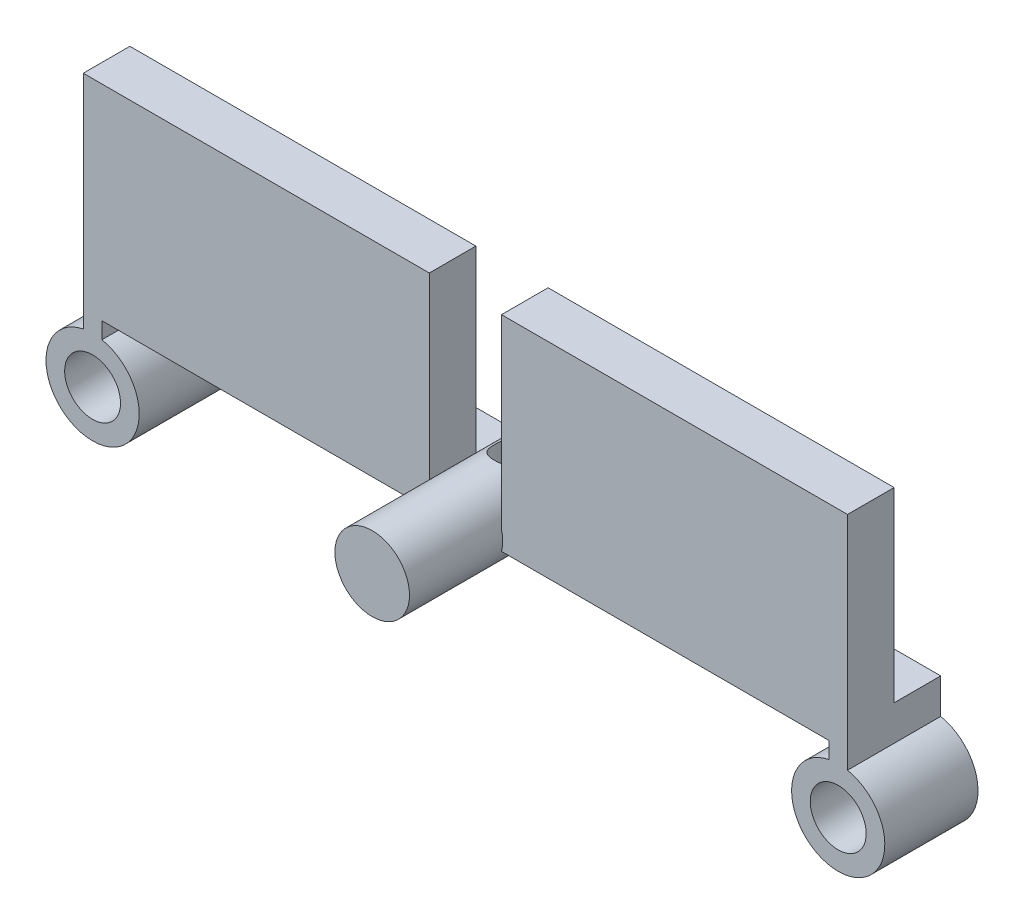
ISO-10303-21;
HEADER;
FILE_DESCRIPTION(('STEP AP214'),'2;1');
FILE_NAME('part.step','',(''),(''),'','','');
FILE_SCHEMA(('AUTOMOTIVE_DESIGN { 1 0 10303 214 1 1 1 1 }'));
ENDSEC;
DATA;
#1=APPLICATION_CONTEXT('core data for automotive mechanical design processes');
#2=APPLICATION_PROTOCOL_DEFINITION('international standard','automotive_design',2000,#1);
#3=PRODUCT_CONTEXT('',#1,'mechanical');
#4=PRODUCT('Part','Part','',(#3));
#5=PRODUCT_RELATED_PRODUCT_CATEGORY('part','',(#4));
#6=PRODUCT_DEFINITION_FORMATION('','',#4);
#7=PRODUCT_DEFINITION_CONTEXT('part definition',#1,'design');
#8=PRODUCT_DEFINITION('design','',#6,#7);
#9=PRODUCT_DEFINITION_SHAPE('','',#8);
#10=(LENGTH_UNIT() NAMED_UNIT(*) SI_UNIT(.MILLI.,.METRE.));
#11=(NAMED_UNIT(*) PLANE_ANGLE_UNIT() SI_UNIT($,.RADIAN.));
#12=(NAMED_UNIT(*) SI_UNIT($,.STERADIAN.) SOLID_ANGLE_UNIT());
#13=UNCERTAINTY_MEASURE_WITH_UNIT(LENGTH_MEASURE(1.E-05),#10,'distance_accuracy_value','');
#14=(GEOMETRIC_REPRESENTATION_CONTEXT(3) GLOBAL_UNCERTAINTY_ASSIGNED_CONTEXT((#13)) GLOBAL_UNIT_ASSIGNED_CONTEXT((#10,
#11,#12)) REPRESENTATION_CONTEXT('',''));
#15=CARTESIAN_POINT('',(0.,0.,0.));
#16=DIRECTION('',(0.,0.,1.));
#17=DIRECTION('',(1.,0.,0.));
#18=AXIS2_PLACEMENT_3D('',#15,#16,#17);
#19=CARTESIAN_POINT('',(6.,1.5,15.));
#20=DIRECTION('',(0.,-1.,0.));
#21=DIRECTION('',(0.,0.,-1.));
#22=AXIS2_PLACEMENT_3D('',#19,#20,#21);
#23=PLANE('',#22);
#24=DIRECTION('',(-1.,0.,0.));
#25=VECTOR('',#24,1.);
#26=CARTESIAN_POINT('',(61.5,1.5,7.5));
#27=LINE('',#26,#25);
#28=CARTESIAN_POINT('',(61.5,1.5,7.5));
#29=VERTEX_POINT('',#28);
#30=CARTESIAN_POINT('',(5.80947501931113,1.5,7.5));
#31=VERTEX_POINT('',#30);
#32=EDGE_CURVE('E181',#29,#31,#27,.T.);
#33=ORIENTED_EDGE('',*,*,#32,.F.);
#34=DIRECTION('',(0.,0.,-1.));
#35=VECTOR('',#34,1.);
#36=CARTESIAN_POINT('',(61.5,1.5,15.));
#37=LINE('',#36,#35);
#38=CARTESIAN_POINT('',(61.5,1.5,0.));
#39=VERTEX_POINT('',#38);
#40=EDGE_CURVE('E378',#29,#39,#37,.T.);
#41=ORIENTED_EDGE('',*,*,#40,.T.);
#42=DIRECTION('',(-1.,0.,0.));
#43=VECTOR('',#42,1.);
#44=CARTESIAN_POINT('',(6.,1.5,0.));
#45=LINE('',#44,#43);
#46=CARTESIAN_POINT('',(5.80947501931113,1.5,0.));
#47=VERTEX_POINT('',#46);
#48=EDGE_CURVE('E358',#39,#47,#45,.T.);
#49=ORIENTED_EDGE('',*,*,#48,.T.);
#50=DIRECTION('',(0.,0.,-1.));
#51=VECTOR('',#50,1.);
#52=CARTESIAN_POINT('',(5.80947501931113,1.5,15.));
#53=LINE('',#52,#51);
#54=EDGE_CURVE('E374',#31,#47,#53,.T.);
#55=ORIENTED_EDGE('',*,*,#54,.F.);
#56=EDGE_LOOP('',(#33,#41,#49,#55));
#57=FACE_BOUND('',#56,.T.);
#58=ADVANCED_FACE('F33',(#57),#23,.F.);
#59=CARTESIAN_POINT('',(-6.,1.5,15.));
#60=DIRECTION('',(0.,-1.,0.));
#61=DIRECTION('',(0.,0.,-1.));
#62=AXIS2_PLACEMENT_3D('',#59,#60,#61);
#63=PLANE('',#62);
#64=DIRECTION('',(-1.,0.,0.));
#65=VECTOR('',#64,1.);
#66=CARTESIAN_POINT('',(-61.5,1.5,7.5));
#67=LINE('',#66,#65);
#68=CARTESIAN_POINT('',(-5.80947501931113,1.5,7.5));
#69=VERTEX_POINT('',#68);
#70=CARTESIAN_POINT('',(-61.5,1.5,7.5));
#71=VERTEX_POINT('',#70);
#72=EDGE_CURVE('E191',#69,#71,#67,.T.);
#73=ORIENTED_EDGE('',*,*,#72,.F.);
#74=DIRECTION('',(0.,0.,-1.));
#75=VECTOR('',#74,1.);
#76=CARTESIAN_POINT('',(-5.80947501931113,1.5,15.));
#77=LINE('',#76,#75);
#78=CARTESIAN_POINT('',(-5.80947501931113,1.5,0.));
#79=VERTEX_POINT('',#78);
#80=EDGE_CURVE('E338',#69,#79,#77,.T.);
#81=ORIENTED_EDGE('',*,*,#80,.T.);
#82=DIRECTION('',(-1.,0.,0.));
#83=VECTOR('',#82,1.);
#84=CARTESIAN_POINT('',(-6.,1.5,0.));
#85=LINE('',#84,#83);
#86=CARTESIAN_POINT('',(-61.5,1.5,0.));
#87=VERTEX_POINT('',#86);
#88=EDGE_CURVE('E330',#79,#87,#85,.T.);
#89=ORIENTED_EDGE('',*,*,#88,.T.);
#90=DIRECTION('',(0.,0.,-1.));
#91=VECTOR('',#90,1.);
#92=CARTESIAN_POINT('',(-61.5,1.5,15.));
#93=LINE('',#92,#91);
#94=EDGE_CURVE('E336',#71,#87,#93,.T.);
#95=ORIENTED_EDGE('',*,*,#94,.F.);
#96=EDGE_LOOP('',(#73,#81,#89,#95));
#97=FACE_BOUND('',#96,.T.);
#98=ADVANCED_FACE('F250',(#97),#63,.F.);
#99=CARTESIAN_POINT('',(0.,0.,30.));
#100=DIRECTION('',(0.,0.,-1.));
#101=DIRECTION('',(-1.,0.,0.));
#102=AXIS2_PLACEMENT_3D('',#99,#100,#101);
#103=CYLINDRICAL_SURFACE('',#102,6.);
#104=CARTESIAN_POINT('',(0.,0.,30.));
#105=DIRECTION('',(0.,0.,1.));
#106=DIRECTION('',(1.,0.,0.));
#107=AXIS2_PLACEMENT_3D('',#104,#105,#106);
#108=CIRCLE('',#107,6.);
#109=CARTESIAN_POINT('',(6.,0.,30.));
#110=VERTEX_POINT('',#109);
#111=EDGE_CURVE('E11',#110,#110,#108,.T.);
#112=ORIENTED_EDGE('',*,*,#111,.F.);
#113=EDGE_LOOP('',(#112));
#114=FACE_BOUND('',#113,.T.);
#115=DIRECTION('',(0.,0.,-1.));
#116=VECTOR('',#115,1.);
#117=CARTESIAN_POINT('',(-5.80947501931113,-1.5,15.));
#118=LINE('',#117,#116);
#119=CARTESIAN_POINT('',(-5.80947501931113,-1.5,15.));
#120=VERTEX_POINT('',#119);
#121=CARTESIAN_POINT('',(-5.80947501931113,-1.5,0.));
#122=VERTEX_POINT('',#121);
#123=EDGE_CURVE('E341',#120,#122,#118,.T.);
#124=ORIENTED_EDGE('',*,*,#123,.T.);
#125=CARTESIAN_POINT('',(0.,0.,0.));
#126=DIRECTION('',(0.,0.,1.));
#127=DIRECTION('',(1.,0.,0.));
#128=AXIS2_PLACEMENT_3D('',#125,#126,#127);
#129=CIRCLE('',#128,6.);
#130=CARTESIAN_POINT('',(5.80947501931113,-1.5,0.));
#131=VERTEX_POINT('',#130);
#132=EDGE_CURVE('E387',#122,#131,#129,.T.);
#133=ORIENTED_EDGE('',*,*,#132,.T.);
#134=DIRECTION('',(0.,0.,-1.));
#135=VECTOR('',#134,1.);
#136=CARTESIAN_POINT('',(5.80947501931113,-1.5,15.));
#137=LINE('',#136,#135);
#138=CARTESIAN_POINT('',(5.80947501931113,-1.5,15.));
#139=VERTEX_POINT('',#138);
#140=EDGE_CURVE('E363',#139,#131,#137,.T.);
#141=ORIENTED_EDGE('',*,*,#140,.F.);
#142=CARTESIAN_POINT('',(0.,0.,15.));
#143=DIRECTION('',(0.,0.,-1.));
#144=DIRECTION('',(1.,0.,0.));
#145=AXIS2_PLACEMENT_3D('',#142,#143,#144);
#146=CIRCLE('',#145,6.);
#147=CARTESIAN_POINT('',(5.80947501931113,1.5,15.));
#148=VERTEX_POINT('',#147);
#149=EDGE_CURVE('E166',#148,#139,#146,.T.);
#150=ORIENTED_EDGE('',*,*,#149,.F.);
#151=EDGE_CURVE('E375',#148,#31,#53,.T.);
#152=ORIENTED_EDGE('',*,*,#151,.T.);
#153=ORIENTED_EDGE('',*,*,#54,.T.);
#154=EDGE_CURVE('E37',#47,#79,#129,.T.);
#155=ORIENTED_EDGE('',*,*,#154,.T.);
#156=ORIENTED_EDGE('',*,*,#80,.F.);
#157=CARTESIAN_POINT('',(-5.80947501931113,1.5,15.));
#158=VERTEX_POINT('',#157);
#159=EDGE_CURVE('E339',#158,#69,#77,.T.);
#160=ORIENTED_EDGE('',*,*,#159,.F.);
#161=CARTESIAN_POINT('',(0.,0.,15.));
#162=DIRECTION('',(0.,0.,-1.));
#163=DIRECTION('',(-1.,0.,0.));
#164=AXIS2_PLACEMENT_3D('',#161,#162,#163);
#165=CIRCLE('',#164,6.);
#166=EDGE_CURVE('E316',#120,#158,#165,.T.);
#167=ORIENTED_EDGE('',*,*,#166,.F.);
#168=EDGE_LOOP('',(#124,#133,#141,#150,#152,#153,#155,#156,#160,#167));
#169=FACE_BOUND('',#168,.T.);
#170=CARTESIAN_POINT('',(0.,-6.,10.3686326872045));
#171=CARTESIAN_POINT('',(-0.15158658010868,-5.99999140515293,10.3686223730118));
#172=CARTESIAN_POINT('',(-0.303383122411709,-5.99419207229846,10.356545559354));
#173=CARTESIAN_POINT('',(-0.60253572321766,-5.97156371124357,10.308745727119));
#174=CARTESIAN_POINT('',(-0.749881718842043,-5.95471139799286,10.2729727868892));
#175=CARTESIAN_POINT('',(-1.03534464139644,-5.91175257090406,10.1794744775879));
#176=CARTESIAN_POINT('',(-1.1734940660491,-5.88568095200791,10.1218318258845));
#177=CARTESIAN_POINT('',(-1.43797983427182,-5.82671436499255,9.9866335051335));
#178=CARTESIAN_POINT('',(-1.56431779099448,-5.79382033062631,9.9090805607721));
#179=CARTESIAN_POINT('',(-1.80965984239072,-5.72209582061351,9.73123826640325));
#180=CARTESIAN_POINT('',(-1.92784165884862,-5.68303447036603,9.62990890257884));
#181=CARTESIAN_POINT('',(-2.14627925110937,-5.60419454513002,9.40961493287194));
#182=CARTESIAN_POINT('',(-2.24652261095166,-5.56441549419361,9.29063821588488));
#183=CARTESIAN_POINT('',(-2.43317844534221,-5.48549152483124,9.02850722284871));
#184=CARTESIAN_POINT('',(-2.51815101596151,-5.44658159157859,8.88424882482953));
#185=CARTESIAN_POINT('',(-2.66227015734172,-5.37761521026281,8.58140534883852));
#186=CARTESIAN_POINT('',(-2.72143391826363,-5.34755287354336,8.42282989208322));
#187=CARTESIAN_POINT('',(-2.80861508630021,-5.30226227084627,8.10519772917509));
#188=CARTESIAN_POINT('',(-2.83822403462999,-5.28628219860438,7.94669009567363));
#189=CARTESIAN_POINT('',(-2.87036532192711,-5.26890645402909,7.62621619479203));
#190=CARTESIAN_POINT('',(-2.87292054167677,-5.26749845733625,7.46425296619552));
#191=CARTESIAN_POINT('',(-2.85205624060256,-5.27881153541397,7.16005870076667));
#192=CARTESIAN_POINT('',(-2.83138667020545,-5.29003696977827,7.01757058235071));
#193=CARTESIAN_POINT('',(-2.76938178303602,-5.32275685305655,6.73840099614937));
#194=CARTESIAN_POINT('',(-2.72804076032932,-5.34425413723316,6.60172114292596));
#195=CARTESIAN_POINT('',(-2.62507017124378,-5.39558775874475,6.33419821213287));
#196=CARTESIAN_POINT('',(-2.5629913813102,-5.42560630342089,6.2035646322113));
#197=CARTESIAN_POINT('',(-2.42064144768803,-5.4905928436716,5.95396851314182));
#198=CARTESIAN_POINT('',(-2.34036224604662,-5.52556302892655,5.83501117700018));
#199=CARTESIAN_POINT('',(-2.15314039725623,-5.60136600086722,5.59778895771529));
#200=CARTESIAN_POINT('',(-2.04419625463906,-5.64241132462493,5.48116633885008));
#201=CARTESIAN_POINT('',(-1.80805107089232,-5.72245517481884,5.26719814932005));
#202=CARTESIAN_POINT('',(-1.68084272299547,-5.76145287351497,5.16986033099003));
#203=CARTESIAN_POINT('',(-1.40542710390248,-5.83488128688662,4.99369572121051));
#204=CARTESIAN_POINT('',(-1.25659337362251,-5.86907389608557,4.91574123497145));
#205=CARTESIAN_POINT('',(-0.945871244773727,-5.92707588745822,4.78658345831107));
#206=CARTESIAN_POINT('',(-0.783992460349442,-5.95089283499949,4.73536067117778));
#207=CARTESIAN_POINT('',(-0.465302848832955,-5.98390617349559,4.66502783558041));
#208=CARTESIAN_POINT('',(-0.309079058295575,-5.99409669517315,4.6437276641836));
#209=CARTESIAN_POINT('',(0.00503588938373956,-6.0020509274174,4.62706892260351));
#210=CARTESIAN_POINT('',(0.16292632631682,-5.99981980265701,4.63169957090706));
#211=CARTESIAN_POINT('',(0.464259893359244,-5.98378351256003,4.66540937711677));
#212=CARTESIAN_POINT('',(0.607944702499527,-5.9707931369952,4.69276780495139));
#213=CARTESIAN_POINT('',(0.888431525381318,-5.93554375512635,4.76854352686602));
#214=CARTESIAN_POINT('',(1.02523274772907,-5.91328368581861,4.8169632361805));
#215=CARTESIAN_POINT('',(1.29279678520628,-5.86070274046471,4.93489685570673));
#216=CARTESIAN_POINT('',(1.42325372372602,-5.83015931852471,5.00500205837242));
#217=CARTESIAN_POINT('',(1.67100639010231,-5.76404416301533,5.16366599860744));
#218=CARTESIAN_POINT('',(1.78829632583928,-5.72847023196996,5.2522328088143));
#219=CARTESIAN_POINT('',(2.01773513627081,-5.65196192121474,5.45468937869738));
#220=CARTESIAN_POINT('',(2.12843284505592,-5.61083484156613,5.57015426588489));
#221=CARTESIAN_POINT('',(2.32947010204666,-5.53039944306041,5.81829270161592));
#222=CARTESIAN_POINT('',(2.41979850587412,-5.49109212912708,5.95097560818129));
#223=CARTESIAN_POINT('',(2.58063619836424,-5.41742128728637,6.2362141058031));
#224=CARTESIAN_POINT('',(2.65027332051552,-5.38329899869582,6.38932905462845));
#225=CARTESIAN_POINT('',(2.76205592690365,-5.32682200718607,6.70727759070407));
#226=CARTESIAN_POINT('',(2.80423361426435,-5.30445352592127,6.8720971986661));
#227=CARTESIAN_POINT('',(2.85627092441441,-5.27660009870987,7.19240903481777));
#228=CARTESIAN_POINT('',(2.86875909797126,-5.26974480949676,7.34735379696022));
#229=CARTESIAN_POINT('',(2.86850447615356,-5.26988548164395,7.65719283056656));
#230=CARTESIAN_POINT('',(2.85576988368717,-5.27687693978687,7.81208710206559));
#231=CARTESIAN_POINT('',(2.80783187156893,-5.30251946642487,8.10441460031893));
#232=CARTESIAN_POINT('',(2.77451063787895,-5.32019136345722,8.24225243512952));
#233=CARTESIAN_POINT('',(2.68853006837801,-5.36415167838219,8.51028864151415));
#234=CARTESIAN_POINT('',(2.63586485088189,-5.39044271672867,8.64048467556151));
#235=CARTESIAN_POINT('',(2.50870742248167,-5.45083924344392,8.89913703056842));
#236=CARTESIAN_POINT('',(2.43299053410809,-5.48534989676625,9.02689404985989));
#237=CARTESIAN_POINT('',(2.26331642941518,-5.5575075638316,9.26869616962616));
#238=CARTESIAN_POINT('',(2.16935030420458,-5.59515610427954,9.38273452872862));
#239=CARTESIAN_POINT('',(1.95400414126395,-5.6741865500506,9.60655284287668));
#240=CARTESIAN_POINT('',(1.83076393747037,-5.71553527912022,9.71456088070317));
#241=CARTESIAN_POINT('',(1.56652510830305,-5.79352320134164,9.90871080353446));
#242=CARTESIAN_POINT('',(1.42551778783034,-5.83016007068187,9.99484191946136));
#243=CARTESIAN_POINT('',(1.20352758032743,-5.87854527686957,10.1052685555798));
#244=CARTESIAN_POINT('',(1.12779622634155,-5.89357693307277,10.1389455177178));
#245=CARTESIAN_POINT('',(0.973305736750535,-5.92104834904765,10.1997420109321));
#246=CARTESIAN_POINT('',(0.894548098959115,-5.93348937193078,10.2268647386874));
#247=CARTESIAN_POINT('',(0.73477698483433,-5.9553835682189,10.2741818680344));
#248=CARTESIAN_POINT('',(0.653769096081175,-5.96484352829789,10.294392015872));
#249=CARTESIAN_POINT('',(0.490036243767408,-5.98051998032694,10.3277004173871));
#250=CARTESIAN_POINT('',(0.407312423643749,-5.9867385643204,10.3408032584729));
#251=CARTESIAN_POINT('',(0.270358441355231,-5.99414752495501,10.3563763413054));
#252=CARTESIAN_POINT('',(0.216414666640132,-5.99633873423277,10.3609688209043));
#253=CARTESIAN_POINT('',(0.108322870265166,-5.99926652488824,10.3670988732495));
#254=CARTESIAN_POINT('',(0.0541748437788067,-6.00000307167361,10.3686363733473));
#255=CARTESIAN_POINT('',(0.,-6.,10.3686326872045));
#256=B_SPLINE_CURVE_WITH_KNOTS('',3,(#170,#171,#172,#173,#174,#175,#176,#177,#178,#179,#180,
#181,#182,#183,#184,#185,#186,#187,#188,#189,#190,#191,#192,#193,#194,#195,#196,#197,#198,#199,
#200,#201,#202,#203,#204,#205,#206,#207,#208,#209,#210,#211,#212,#213,#214,#215,#216,#217,#218,
#219,#220,#221,#222,#223,#224,#225,#226,#227,#228,#229,#230,#231,#232,#233,#234,#235,#236,#237,
#238,#239,#240,#241,#242,#243,#244,#245,#246,#247,#248,#249,#250,#251,#252,#253,#254,#255),
.UNSPECIFIED.,.T.,.F.,(4,2,2,2,2,2,2,2,2,2,2,2,2,2,2,2,2,2,2,2,2,2,2,2,2,2,2,2,2,2,2,2,2,2,2,2,
2,2,2,2,2,2,4),(0.,0.454549483227423,0.910059644154008,1.36386384151152,1.81760596968969,
2.29708125885325,2.77688714015001,3.28994367017261,3.80265795113446,4.28597040923415,
4.76887407150454,5.20010879105978,5.63146260996222,6.0728421716365,6.51441753027289,
7.00660727095316,7.49899446828105,8.01062859571877,8.52188904045543,8.99333540000926,
9.46458575620904,9.90309939765261,10.3416633395779,10.793433502345,11.2454016249041,
11.7387040698317,12.232275757247,12.7443921085178,13.2559067869394,13.720106094035,
14.1841544597529,14.611018774709,15.0380129885904,15.4935777547266,15.9493654795234,
16.4540914816676,16.9590654595215,17.2114781417624,17.4637674658487,17.7154782088944,
17.9670262914301,18.1294718169713,18.2919212054721),.UNSPECIFIED.);
#257=CARTESIAN_POINT('',(0.,-6.,10.3686326872045));
#258=VERTEX_POINT('',#257);
#259=EDGE_CURVE('E208',#258,#258,#256,.T.);
#260=ORIENTED_EDGE('',*,*,#259,.F.);
#261=EDGE_LOOP('',(#260));
#262=FACE_BOUND('',#261,.T.);
#263=CARTESIAN_POINT('',(0.,6.,4.63136731279549));
#264=CARTESIAN_POINT('',(0.151586580108681,5.99999140515292,4.63137762698816));
#265=CARTESIAN_POINT('',(0.303383122411709,5.99419207229846,4.64345444064599));
#266=CARTESIAN_POINT('',(0.602535723217661,5.97156371124358,4.69125427288099));
#267=CARTESIAN_POINT('',(0.749881718842044,5.95471139799286,4.72702721311076));
#268=CARTESIAN_POINT('',(1.03534464139644,5.91175257090406,4.8205255224121));
#269=CARTESIAN_POINT('',(1.1734940660491,5.88568095200791,4.87816817411553));
#270=CARTESIAN_POINT('',(1.43797983427182,5.82671436499255,5.0133664948665));
#271=CARTESIAN_POINT('',(1.56431779099448,5.79382033062631,5.0909194392279));
#272=CARTESIAN_POINT('',(1.80965984239072,5.72209582061351,5.26876173359675));
#273=CARTESIAN_POINT('',(1.92784165884862,5.68303447036603,5.37009109742116));
#274=CARTESIAN_POINT('',(2.14627925110937,5.60419454513002,5.59038506712806));
#275=CARTESIAN_POINT('',(2.24652261095166,5.56441549419361,5.70936178411512));
#276=CARTESIAN_POINT('',(2.43317844534221,5.48549152483124,5.97149277715129));
#277=CARTESIAN_POINT('',(2.51815101596151,5.44658159157859,6.11575117517047));
#278=CARTESIAN_POINT('',(2.66227015734172,5.37761521026281,6.41859465116148));
#279=CARTESIAN_POINT('',(2.72143391826363,5.34755287354336,6.57717010791678));
#280=CARTESIAN_POINT('',(2.80861508630021,5.30226227084627,6.89480227082491));
#281=CARTESIAN_POINT('',(2.83822403462999,5.28628219860438,7.05330990432637));
#282=CARTESIAN_POINT('',(2.87036532192711,5.26890645402909,7.37378380520797));
#283=CARTESIAN_POINT('',(2.87292054167677,5.26749845733625,7.53574703380448));
#284=CARTESIAN_POINT('',(2.85205624060256,5.27881153541397,7.83994129923333));
#285=CARTESIAN_POINT('',(2.83138667020545,5.29003696977827,7.98242941764929));
#286=CARTESIAN_POINT('',(2.76938178303602,5.32275685305655,8.26159900385063));
#287=CARTESIAN_POINT('',(2.72804076032932,5.34425413723316,8.39827885707404));
#288=CARTESIAN_POINT('',(2.62507017124378,5.39558775874475,8.66580178786713));
#289=CARTESIAN_POINT('',(2.5629913813102,5.42560630342089,8.79643536778869));
#290=CARTESIAN_POINT('',(2.42064144768804,5.4905928436716,9.04603148685818));
#291=CARTESIAN_POINT('',(2.34036224604662,5.52556302892655,9.16498882299982));
#292=CARTESIAN_POINT('',(2.15314039725623,5.60136600086722,9.40221104228471));
#293=CARTESIAN_POINT('',(2.04419625463906,5.64241132462493,9.51883366114992));
#294=CARTESIAN_POINT('',(1.80805107089232,5.72245517481884,9.73280185067995));
#295=CARTESIAN_POINT('',(1.68084272299547,5.76145287351497,9.83013966900997));
#296=CARTESIAN_POINT('',(1.40542710390248,5.83488128688663,10.0063042787895));
#297=CARTESIAN_POINT('',(1.25659337362251,5.86907389608557,10.0842587650286));
#298=CARTESIAN_POINT('',(0.945871244773726,5.92707588745822,10.2134165416889));
#299=CARTESIAN_POINT('',(0.783992460349442,5.95089283499949,10.2646393288222));
#300=CARTESIAN_POINT('',(0.465302848832955,5.98390617349559,10.3349721644196));
#301=CARTESIAN_POINT('',(0.309079058295575,5.99409669517315,10.3562723358164));
#302=CARTESIAN_POINT('',(-0.0050358893837398,6.0020509274174,10.3729310773965));
#303=CARTESIAN_POINT('',(-0.162926326316821,5.99981980265701,10.3683004290929));
#304=CARTESIAN_POINT('',(-0.464259893359244,5.98378351256003,10.3345906228832));
#305=CARTESIAN_POINT('',(-0.607944702499527,5.9707931369952,10.3072321950486));
#306=CARTESIAN_POINT('',(-0.888431525381319,5.93554375512635,10.231456473134));
#307=CARTESIAN_POINT('',(-1.02523274772907,5.91328368581861,10.1830367638195));
#308=CARTESIAN_POINT('',(-1.29279678520629,5.86070274046471,10.0651031442933));
#309=CARTESIAN_POINT('',(-1.42325372372602,5.83015931852471,9.99499794162758));
#310=CARTESIAN_POINT('',(-1.67100639010231,5.76404416301533,9.83633400139256));
#311=CARTESIAN_POINT('',(-1.78829632583928,5.72847023196996,9.74776719118569));
#312=CARTESIAN_POINT('',(-2.01773513627081,5.65196192121474,9.54531062130262));
#313=CARTESIAN_POINT('',(-2.12843284505592,5.61083484156613,9.42984573411511));
#314=CARTESIAN_POINT('',(-2.32947010204666,5.53039944306041,9.18170729838408));
#315=CARTESIAN_POINT('',(-2.41979850587413,5.49109212912708,9.04902439181871));
#316=CARTESIAN_POINT('',(-2.58063619836424,5.41742128728637,8.7637858941969));
#317=CARTESIAN_POINT('',(-2.65027332051553,5.38329899869581,8.61067094537154));
#318=CARTESIAN_POINT('',(-2.76205592690365,5.32682200718607,8.29272240929592));
#319=CARTESIAN_POINT('',(-2.80423361426435,5.30445352592127,8.12790280133389));
#320=CARTESIAN_POINT('',(-2.85627092441441,5.27660009870987,7.80759096518223));
#321=CARTESIAN_POINT('',(-2.86875909797126,5.26974480949676,7.65264620303978));
#322=CARTESIAN_POINT('',(-2.86850447615356,5.26988548164395,7.34280716943344));
#323=CARTESIAN_POINT('',(-2.85576988368717,5.27687693978687,7.18791289793441));
#324=CARTESIAN_POINT('',(-2.80783187156893,5.30251946642487,6.89558539968107));
#325=CARTESIAN_POINT('',(-2.77451063787895,5.32019136345722,6.75774756487048));
#326=CARTESIAN_POINT('',(-2.68853006837801,5.36415167838219,6.48971135848585));
#327=CARTESIAN_POINT('',(-2.63586485088189,5.39044271672867,6.35951532443849));
#328=CARTESIAN_POINT('',(-2.50870742248167,5.45083924344392,6.10086296943158));
#329=CARTESIAN_POINT('',(-2.43299053410809,5.48534989676625,5.97310595014011));
#330=CARTESIAN_POINT('',(-2.26331642941518,5.5575075638316,5.73130383037384));
#331=CARTESIAN_POINT('',(-2.16935030420458,5.59515610427954,5.61726547127138));
#332=CARTESIAN_POINT('',(-1.95400414126395,5.6741865500506,5.39344715712332));
#333=CARTESIAN_POINT('',(-1.83076393747037,5.71553527912022,5.28543911929683));
#334=CARTESIAN_POINT('',(-1.56652510830306,5.79352320134164,5.09128919646554));
#335=CARTESIAN_POINT('',(-1.42551778783034,5.83016007068187,5.00515808053864));
#336=CARTESIAN_POINT('',(-1.20352758032743,5.87854527686957,4.89473144442019));
#337=CARTESIAN_POINT('',(-1.12779622634155,5.89357693307277,4.86105448228219));
#338=CARTESIAN_POINT('',(-0.973305736750538,5.92104834904765,4.80025798906786));
#339=CARTESIAN_POINT('',(-0.894548098959118,5.93348937193078,4.77313526131259));
#340=CARTESIAN_POINT('',(-0.734776984834333,5.9553835682189,4.72581813196559));
#341=CARTESIAN_POINT('',(-0.653769096081177,5.96484352829789,4.70560798412797));
#342=CARTESIAN_POINT('',(-0.49003624376741,5.98051998032694,4.67229958261287));
#343=CARTESIAN_POINT('',(-0.407312423643751,5.9867385643204,4.65919674152709));
#344=CARTESIAN_POINT('',(-0.270358441355233,5.99414752495501,4.64362365869463));
#345=CARTESIAN_POINT('',(-0.216414666640134,5.99633873423277,4.63903117909565));
#346=CARTESIAN_POINT('',(-0.108322870265168,5.99926652488825,4.63290112675051));
#347=CARTESIAN_POINT('',(-0.0541748437788076,6.00000307167361,4.63136362665271));
#348=CARTESIAN_POINT('',(0.,6.,4.63136731279549));
#349=B_SPLINE_CURVE_WITH_KNOTS('',3,(#263,#264,#265,#266,#267,#268,#269,#270,#271,#272,#273,
#274,#275,#276,#277,#278,#279,#280,#281,#282,#283,#284,#285,#286,#287,#288,#289,#290,#291,#292,
#293,#294,#295,#296,#297,#298,#299,#300,#301,#302,#303,#304,#305,#306,#307,#308,#309,#310,#311,
#312,#313,#314,#315,#316,#317,#318,#319,#320,#321,#322,#323,#324,#325,#326,#327,#328,#329,#330,
#331,#332,#333,#334,#335,#336,#337,#338,#339,#340,#341,#342,#343,#344,#345,#346,#347,#348),
.UNSPECIFIED.,.T.,.F.,(4,2,2,2,2,2,2,2,2,2,2,2,2,2,2,2,2,2,2,2,2,2,2,2,2,2,2,2,2,2,2,2,2,2,2,2,
2,2,2,2,2,2,4),(0.,0.454549483227424,0.910059644154009,1.36386384151152,1.8176059696897,
2.29708125885325,2.77688714015001,3.28994367017261,3.80265795113446,4.28597040923415,
4.76887407150455,5.20010879105978,5.63146260996222,6.0728421716365,6.51441753027289,
7.00660727095316,7.49899446828105,8.01062859571878,8.52188904045543,8.99333540000926,
9.46458575620904,9.90309939765261,10.3416633395779,10.793433502345,11.2454016249041,
11.7387040698317,12.232275757247,12.7443921085178,13.2559067869394,13.720106094035,
14.1841544597529,14.611018774709,15.0380129885904,15.4935777547266,15.9493654795234,
16.4540914816676,16.9590654595215,17.2114781417624,17.4637674658487,17.7154782088944,
17.9670262914301,18.1294718169713,18.2919212054721),.UNSPECIFIED.);
#350=CARTESIAN_POINT('',(0.,6.,4.63136731279549));
#351=VERTEX_POINT('',#350);
#352=EDGE_CURVE('E216',#351,#351,#349,.T.);
#353=ORIENTED_EDGE('',*,*,#352,.T.);
#354=EDGE_LOOP('',(#353));
#355=FACE_BOUND('',#354,.T.);
#356=ADVANCED_FACE('F35',(#114,#169,#262,#355),#103,.T.);
#357=CARTESIAN_POINT('',(0.,0.,30.));
#358=DIRECTION('',(0.,0.,1.));
#359=DIRECTION('',(1.,0.,0.));
#360=AXIS2_PLACEMENT_3D('',#357,#358,#359);
#361=PLANE('',#360);
#362=ORIENTED_EDGE('',*,*,#111,.T.);
#363=EDGE_LOOP('',(#362));
#364=FACE_BOUND('',#363,.T.);
#365=ADVANCED_FACE('F278',(#364),#361,.T.);
#366=CARTESIAN_POINT('',(0.,0.,0.));
#367=DIRECTION('',(0.,0.,1.));
#368=DIRECTION('',(1.,0.,0.));
#369=AXIS2_PLACEMENT_3D('',#366,#367,#368);
#370=PLANE('',#369);
#371=ORIENTED_EDGE('',*,*,#154,.F.);
#372=ORIENTED_EDGE('',*,*,#48,.F.);
#373=DIRECTION('',(0.,1.,0.));
#374=VECTOR('',#373,1.);
#375=CARTESIAN_POINT('',(61.5,1.5,0.));
#376=LINE('',#375,#374);
#377=CARTESIAN_POINT('',(61.5,-4.15153077165045,0.));
#378=VERTEX_POINT('',#377);
#379=EDGE_CURVE('E369',#378,#39,#376,.T.);
#380=ORIENTED_EDGE('',*,*,#379,.F.);
#381=CARTESIAN_POINT('',(60.,-11.5,0.));
#382=DIRECTION('',(0.,0.,1.));
#383=DIRECTION('',(1.,0.,0.));
#384=AXIS2_PLACEMENT_3D('',#381,#382,#383);
#385=CIRCLE('',#384,7.50000000000001);
#386=CARTESIAN_POINT('',(58.5,-4.15153077165045,0.));
#387=VERTEX_POINT('',#386);
#388=EDGE_CURVE('E367',#387,#378,#385,.T.);
#389=ORIENTED_EDGE('',*,*,#388,.F.);
#390=DIRECTION('',(0.,-1.,0.));
#391=VECTOR('',#390,1.);
#392=CARTESIAN_POINT('',(58.5,-1.5,0.));
#393=LINE('',#392,#391);
#394=CARTESIAN_POINT('',(58.5,-1.5,0.));
#395=VERTEX_POINT('',#394);
#396=EDGE_CURVE('E365',#395,#387,#393,.T.);
#397=ORIENTED_EDGE('',*,*,#396,.F.);
#398=DIRECTION('',(1.,0.,0.));
#399=VECTOR('',#398,1.);
#400=CARTESIAN_POINT('',(6.,-1.5,0.));
#401=LINE('',#400,#399);
#402=EDGE_CURVE('E353',#131,#395,#401,.T.);
#403=ORIENTED_EDGE('',*,*,#402,.F.);
#404=ORIENTED_EDGE('',*,*,#132,.F.);
#405=DIRECTION('',(1.,0.,0.));
#406=VECTOR('',#405,1.);
#407=CARTESIAN_POINT('',(-6.,-1.5,0.));
#408=LINE('',#407,#406);
#409=CARTESIAN_POINT('',(-58.5,-1.5,0.));
#410=VERTEX_POINT('',#409);
#411=EDGE_CURVE('E327',#410,#122,#408,.T.);
#412=ORIENTED_EDGE('',*,*,#411,.F.);
#413=DIRECTION('',(0.,1.,0.));
#414=VECTOR('',#413,1.);
#415=CARTESIAN_POINT('',(-58.5,-1.5,0.));
#416=LINE('',#415,#414);
#417=CARTESIAN_POINT('',(-58.5,-4.15153077165045,0.));
#418=VERTEX_POINT('',#417);
#419=EDGE_CURVE('E324',#418,#410,#416,.T.);
#420=ORIENTED_EDGE('',*,*,#419,.F.);
#421=CARTESIAN_POINT('',(-60.,-11.5,0.));
#422=DIRECTION('',(0.,0.,1.));
#423=DIRECTION('',(-1.,0.,0.));
#424=AXIS2_PLACEMENT_3D('',#421,#422,#423);
#425=CIRCLE('',#424,7.50000000000001);
#426=CARTESIAN_POINT('',(-61.5,-4.15153077165045,0.));
#427=VERTEX_POINT('',#426);
#428=EDGE_CURVE('E304',#427,#418,#425,.T.);
#429=ORIENTED_EDGE('',*,*,#428,.F.);
#430=DIRECTION('',(0.,-1.,0.));
#431=VECTOR('',#430,1.);
#432=CARTESIAN_POINT('',(-61.5,1.5,0.));
#433=LINE('',#432,#431);
#434=EDGE_CURVE('E311',#87,#427,#433,.T.);
#435=ORIENTED_EDGE('',*,*,#434,.F.);
#436=ORIENTED_EDGE('',*,*,#88,.F.);
#437=EDGE_LOOP('',(#371,#372,#380,#389,#397,#403,#404,#412,#420,#429,#435,#436));
#438=FACE_BOUND('',#437,.T.);
#439=CARTESIAN_POINT('',(60.,-11.5,0.));
#440=DIRECTION('',(0.,0.,1.));
#441=DIRECTION('',(1.,0.,0.));
#442=AXIS2_PLACEMENT_3D('',#439,#440,#441);
#443=CIRCLE('',#442,4.5);
#444=CARTESIAN_POINT('',(64.5,-11.5,0.));
#445=VERTEX_POINT('',#444);
#446=EDGE_CURVE('E296',#445,#445,#443,.T.);
#447=ORIENTED_EDGE('',*,*,#446,.T.);
#448=EDGE_LOOP('',(#447));
#449=FACE_BOUND('',#448,.T.);
#450=CARTESIAN_POINT('',(-60.,-11.5,0.));
#451=DIRECTION('',(0.,0.,1.));
#452=DIRECTION('',(-1.,0.,0.));
#453=AXIS2_PLACEMENT_3D('',#450,#451,#452);
#454=CIRCLE('',#453,4.5);
#455=CARTESIAN_POINT('',(-64.5,-11.5,0.));
#456=VERTEX_POINT('',#455);
#457=EDGE_CURVE('E299',#456,#456,#454,.T.);
#458=ORIENTED_EDGE('',*,*,#457,.T.);
#459=EDGE_LOOP('',(#458));
#460=FACE_BOUND('',#459,.T.);
#461=ADVANCED_FACE('F280',(#438,#449,#460),#370,.F.);
#462=CARTESIAN_POINT('',(0.,0.,15.));
#463=DIRECTION('',(0.,0.,1.));
#464=DIRECTION('',(1.,0.,0.));
#465=AXIS2_PLACEMENT_3D('',#462,#463,#464);
#466=PLANE('',#465);
#467=DIRECTION('',(1.,0.,0.));
#468=VECTOR('',#467,1.);
#469=CARTESIAN_POINT('',(6.,-1.5,15.));
#470=LINE('',#469,#468);
#471=CARTESIAN_POINT('',(58.5,-1.5,15.));
#472=VERTEX_POINT('',#471);
#473=EDGE_CURVE('E355',#139,#472,#470,.T.);
#474=ORIENTED_EDGE('',*,*,#473,.T.);
#475=DIRECTION('',(0.,-1.,0.));
#476=VECTOR('',#475,1.);
#477=CARTESIAN_POINT('',(58.5,-1.5,15.));
#478=LINE('',#477,#476);
#479=CARTESIAN_POINT('',(58.5,-4.15153077165045,15.));
#480=VERTEX_POINT('',#479);
#481=EDGE_CURVE('E357',#472,#480,#478,.T.);
#482=ORIENTED_EDGE('',*,*,#481,.T.);
#483=CARTESIAN_POINT('',(60.,-11.5,15.));
#484=DIRECTION('',(0.,0.,1.));
#485=DIRECTION('',(1.,0.,0.));
#486=AXIS2_PLACEMENT_3D('',#483,#484,#485);
#487=CIRCLE('',#486,7.50000000000001);
#488=CARTESIAN_POINT('',(61.5,-4.15153077165045,15.));
#489=VERTEX_POINT('',#488);
#490=EDGE_CURVE('E162',#480,#489,#487,.T.);
#491=ORIENTED_EDGE('',*,*,#490,.T.);
#492=DIRECTION('',(0.,1.,0.));
#493=VECTOR('',#492,1.);
#494=CARTESIAN_POINT('',(61.5,1.5,15.));
#495=LINE('',#494,#493);
#496=CARTESIAN_POINT('',(61.5,31.5,15.));
#497=VERTEX_POINT('',#496);
#498=EDGE_CURVE('E154',#489,#497,#495,.T.);
#499=ORIENTED_EDGE('',*,*,#498,.T.);
#500=DIRECTION('',(1.,0.,0.));
#501=VECTOR('',#500,1.);
#502=CARTESIAN_POINT('',(61.5,31.5,15.));
#503=LINE('',#502,#501);
#504=CARTESIAN_POINT('',(5.80947501931113,31.5,15.));
#505=VERTEX_POINT('',#504);
#506=EDGE_CURVE('E160',#505,#497,#503,.T.);
#507=ORIENTED_EDGE('',*,*,#506,.F.);
#508=DIRECTION('',(0.,-1.,0.));
#509=VECTOR('',#508,1.);
#510=CARTESIAN_POINT('',(5.80947501931113,31.5,15.));
#511=LINE('',#510,#509);
#512=EDGE_CURVE('E186',#505,#148,#511,.T.);
#513=ORIENTED_EDGE('',*,*,#512,.T.);
#514=ORIENTED_EDGE('',*,*,#149,.T.);
#515=EDGE_LOOP('',(#474,#482,#491,#499,#507,#513,#514));
#516=FACE_BOUND('',#515,.T.);
#517=CARTESIAN_POINT('',(60.,-11.5,15.));
#518=DIRECTION('',(0.,0.,1.));
#519=DIRECTION('',(1.,0.,0.));
#520=AXIS2_PLACEMENT_3D('',#517,#518,#519);
#521=CIRCLE('',#520,4.5);
#522=CARTESIAN_POINT('',(64.5,-11.5,15.));
#523=VERTEX_POINT('',#522);
#524=EDGE_CURVE('E350',#523,#523,#521,.T.);
#525=ORIENTED_EDGE('',*,*,#524,.F.);
#526=EDGE_LOOP('',(#525));
#527=FACE_BOUND('',#526,.T.);
#528=ADVANCED_FACE('F156',(#516,#527),#466,.T.);
#529=CARTESIAN_POINT('',(6.,-1.5,15.));
#530=DIRECTION('',(0.,1.,0.));
#531=DIRECTION('',(0.,0.,1.));
#532=AXIS2_PLACEMENT_3D('',#529,#530,#531);
#533=PLANE('',#532);
#534=ORIENTED_EDGE('',*,*,#402,.T.);
#535=DIRECTION('',(0.,0.,-1.));
#536=VECTOR('',#535,1.);
#537=CARTESIAN_POINT('',(58.5,-1.5,15.));
#538=LINE('',#537,#536);
#539=EDGE_CURVE('E385',#472,#395,#538,.T.);
#540=ORIENTED_EDGE('',*,*,#539,.F.);
#541=ORIENTED_EDGE('',*,*,#473,.F.);
#542=ORIENTED_EDGE('',*,*,#140,.T.);
#543=EDGE_LOOP('',(#534,#540,#541,#542));
#544=FACE_BOUND('',#543,.T.);
#545=ADVANCED_FACE('F273',(#544),#533,.F.);
#546=CARTESIAN_POINT('',(58.5,-1.5,15.));
#547=DIRECTION('',(1.,0.,0.));
#548=DIRECTION('',(0.,0.,-1.));
#549=AXIS2_PLACEMENT_3D('',#546,#547,#548);
#550=PLANE('',#549);
#551=ORIENTED_EDGE('',*,*,#396,.T.);
#552=DIRECTION('',(0.,0.,-1.));
#553=VECTOR('',#552,1.);
#554=CARTESIAN_POINT('',(58.5,-4.15153077165045,15.));
#555=LINE('',#554,#553);
#556=EDGE_CURVE('E382',#480,#387,#555,.T.);
#557=ORIENTED_EDGE('',*,*,#556,.F.);
#558=ORIENTED_EDGE('',*,*,#481,.F.);
#559=ORIENTED_EDGE('',*,*,#539,.T.);
#560=EDGE_LOOP('',(#551,#557,#558,#559));
#561=FACE_BOUND('',#560,.T.);
#562=ADVANCED_FACE('F269',(#561),#550,.F.);
#563=CARTESIAN_POINT('',(60.,-11.5,15.));
#564=DIRECTION('',(0.,0.,-1.));
#565=DIRECTION('',(-1.,0.,0.));
#566=AXIS2_PLACEMENT_3D('',#563,#564,#565);
#567=CYLINDRICAL_SURFACE('',#566,7.50000000000001);
#568=ORIENTED_EDGE('',*,*,#388,.T.);
#569=DIRECTION('',(0.,0.,-1.));
#570=VECTOR('',#569,1.);
#571=CARTESIAN_POINT('',(61.5,-4.15153077165045,15.));
#572=LINE('',#571,#570);
#573=EDGE_CURVE('E380',#489,#378,#572,.T.);
#574=ORIENTED_EDGE('',*,*,#573,.F.);
#575=ORIENTED_EDGE('',*,*,#490,.F.);
#576=ORIENTED_EDGE('',*,*,#556,.T.);
#577=EDGE_LOOP('',(#568,#574,#575,#576));
#578=FACE_BOUND('',#577,.T.);
#579=ADVANCED_FACE('F266',(#578),#567,.T.);
#580=CARTESIAN_POINT('',(61.5,1.5,15.));
#581=DIRECTION('',(-1.,0.,0.));
#582=DIRECTION('',(0.,0.,1.));
#583=AXIS2_PLACEMENT_3D('',#580,#581,#582);
#584=PLANE('',#583);
#585=ORIENTED_EDGE('',*,*,#379,.T.);
#586=ORIENTED_EDGE('',*,*,#40,.F.);
#587=DIRECTION('',(0.,-1.,0.));
#588=VECTOR('',#587,1.);
#589=CARTESIAN_POINT('',(61.5,31.5,7.5));
#590=LINE('',#589,#588);
#591=CARTESIAN_POINT('',(61.5,31.5,7.5));
#592=VERTEX_POINT('',#591);
#593=EDGE_CURVE('E173',#592,#29,#590,.T.);
#594=ORIENTED_EDGE('',*,*,#593,.F.);
#595=DIRECTION('',(0.,0.,-1.));
#596=VECTOR('',#595,1.);
#597=CARTESIAN_POINT('',(61.5,31.5,15.));
#598=LINE('',#597,#596);
#599=EDGE_CURVE('E169',#497,#592,#598,.T.);
#600=ORIENTED_EDGE('',*,*,#599,.F.);
#601=ORIENTED_EDGE('',*,*,#498,.F.);
#602=ORIENTED_EDGE('',*,*,#573,.T.);
#603=EDGE_LOOP('',(#585,#586,#594,#600,#601,#602));
#604=FACE_BOUND('',#603,.T.);
#605=ADVANCED_FACE('F171',(#604),#584,.F.);
#606=CARTESIAN_POINT('',(60.,-11.5,15.));
#607=DIRECTION('',(0.,0.,-1.));
#608=DIRECTION('',(-1.,0.,0.));
#609=AXIS2_PLACEMENT_3D('',#606,#607,#608);
#610=CYLINDRICAL_SURFACE('',#609,4.5);
#611=ORIENTED_EDGE('',*,*,#524,.T.);
#612=EDGE_LOOP('',(#611));
#613=FACE_BOUND('',#612,.T.);
#614=ORIENTED_EDGE('',*,*,#446,.F.);
#615=EDGE_LOOP('',(#614));
#616=FACE_BOUND('',#615,.T.);
#617=ADVANCED_FACE('F265',(#613,#616),#610,.F.);
#618=CARTESIAN_POINT('',(-60.,-11.5,15.));
#619=DIRECTION('',(0.,0.,-1.));
#620=DIRECTION('',(-1.,0.,0.));
#621=AXIS2_PLACEMENT_3D('',#618,#619,#620);
#622=PLANE('',#621);
#623=CARTESIAN_POINT('',(-60.,-11.5,15.));
#624=DIRECTION('',(0.,0.,1.));
#625=DIRECTION('',(-1.,0.,0.));
#626=AXIS2_PLACEMENT_3D('',#623,#624,#625);
#627=CIRCLE('',#626,7.50000000000001);
#628=CARTESIAN_POINT('',(-61.5,-4.15153077165045,15.));
#629=VERTEX_POINT('',#628);
#630=CARTESIAN_POINT('',(-58.5,-4.15153077165045,15.));
#631=VERTEX_POINT('',#630);
#632=EDGE_CURVE('E307',#629,#631,#627,.T.);
#633=ORIENTED_EDGE('',*,*,#632,.T.);
#634=DIRECTION('',(0.,1.,0.));
#635=VECTOR('',#634,1.);
#636=CARTESIAN_POINT('',(-58.5,-1.5,15.));
#637=LINE('',#636,#635);
#638=CARTESIAN_POINT('',(-58.5,-1.5,15.));
#639=VERTEX_POINT('',#638);
#640=EDGE_CURVE('E310',#631,#639,#637,.T.);
#641=ORIENTED_EDGE('',*,*,#640,.T.);
#642=DIRECTION('',(1.,0.,0.));
#643=VECTOR('',#642,1.);
#644=CARTESIAN_POINT('',(-6.,-1.5,15.));
#645=LINE('',#644,#643);
#646=EDGE_CURVE('E313',#639,#120,#645,.T.);
#647=ORIENTED_EDGE('',*,*,#646,.T.);
#648=ORIENTED_EDGE('',*,*,#166,.T.);
#649=DIRECTION('',(0.,-1.,0.));
#650=VECTOR('',#649,1.);
#651=CARTESIAN_POINT('',(-5.80947501931113,31.5,15.));
#652=LINE('',#651,#650);
#653=CARTESIAN_POINT('',(-5.80947501931113,31.5,15.));
#654=VERTEX_POINT('',#653);
#655=EDGE_CURVE('E206',#654,#158,#652,.T.);
#656=ORIENTED_EDGE('',*,*,#655,.F.);
#657=DIRECTION('',(1.,0.,0.));
#658=VECTOR('',#657,1.);
#659=CARTESIAN_POINT('',(-61.5,31.5,15.));
#660=LINE('',#659,#658);
#661=CARTESIAN_POINT('',(-61.5,31.5,15.));
#662=VERTEX_POINT('',#661);
#663=EDGE_CURVE('E195',#662,#654,#660,.T.);
#664=ORIENTED_EDGE('',*,*,#663,.F.);
#665=DIRECTION('',(0.,-1.,0.));
#666=VECTOR('',#665,1.);
#667=CARTESIAN_POINT('',(-61.5,1.5,15.));
#668=LINE('',#667,#666);
#669=EDGE_CURVE('E319',#662,#629,#668,.T.);
#670=ORIENTED_EDGE('',*,*,#669,.T.);
#671=EDGE_LOOP('',(#633,#641,#647,#648,#656,#664,#670));
#672=FACE_BOUND('',#671,.T.);
#673=CARTESIAN_POINT('',(-60.,-11.5,15.));
#674=DIRECTION('',(0.,0.,1.));
#675=DIRECTION('',(-1.,0.,0.));
#676=AXIS2_PLACEMENT_3D('',#673,#674,#675);
#677=CIRCLE('',#676,4.5);
#678=CARTESIAN_POINT('',(-64.5,-11.5,15.));
#679=VERTEX_POINT('',#678);
#680=EDGE_CURVE('E301',#679,#679,#677,.T.);
#681=ORIENTED_EDGE('',*,*,#680,.F.);
#682=EDGE_LOOP('',(#681));
#683=FACE_BOUND('',#682,.T.);
#684=ADVANCED_FACE('F406',(#672,#683),#622,.F.);
#685=CARTESIAN_POINT('',(-60.,-11.5,15.));
#686=DIRECTION('',(0.,0.,-1.));
#687=DIRECTION('',(-1.,0.,0.));
#688=AXIS2_PLACEMENT_3D('',#685,#686,#687);
#689=CYLINDRICAL_SURFACE('',#688,7.50000000000001);
#690=ORIENTED_EDGE('',*,*,#428,.T.);
#691=DIRECTION('',(0.,0.,-1.));
#692=VECTOR('',#691,1.);
#693=CARTESIAN_POINT('',(-58.5,-4.15153077165045,15.));
#694=LINE('',#693,#692);
#695=EDGE_CURVE('E347',#631,#418,#694,.T.);
#696=ORIENTED_EDGE('',*,*,#695,.F.);
#697=ORIENTED_EDGE('',*,*,#632,.F.);
#698=DIRECTION('',(0.,0.,-1.));
#699=VECTOR('',#698,1.);
#700=CARTESIAN_POINT('',(-61.5,-4.15153077165045,15.));
#701=LINE('',#700,#699);
#702=EDGE_CURVE('E321',#629,#427,#701,.T.);
#703=ORIENTED_EDGE('',*,*,#702,.T.);
#704=EDGE_LOOP('',(#690,#696,#697,#703));
#705=FACE_BOUND('',#704,.T.);
#706=ADVANCED_FACE('F419',(#705),#689,.T.);
#707=CARTESIAN_POINT('',(-58.5,-1.5,15.));
#708=DIRECTION('',(-1.,0.,0.));
#709=DIRECTION('',(0.,0.,1.));
#710=AXIS2_PLACEMENT_3D('',#707,#708,#709);
#711=PLANE('',#710);
#712=ORIENTED_EDGE('',*,*,#419,.T.);
#713=DIRECTION('',(0.,0.,-1.));
#714=VECTOR('',#713,1.);
#715=CARTESIAN_POINT('',(-58.5,-1.5,15.));
#716=LINE('',#715,#714);
#717=EDGE_CURVE('E344',#639,#410,#716,.T.);
#718=ORIENTED_EDGE('',*,*,#717,.F.);
#719=ORIENTED_EDGE('',*,*,#640,.F.);
#720=ORIENTED_EDGE('',*,*,#695,.T.);
#721=EDGE_LOOP('',(#712,#718,#719,#720));
#722=FACE_BOUND('',#721,.T.);
#723=ADVANCED_FACE('F415',(#722),#711,.F.);
#724=CARTESIAN_POINT('',(-6.,-1.5,15.));
#725=DIRECTION('',(0.,1.,0.));
#726=DIRECTION('',(0.,0.,1.));
#727=AXIS2_PLACEMENT_3D('',#724,#725,#726);
#728=PLANE('',#727);
#729=ORIENTED_EDGE('',*,*,#411,.T.);
#730=ORIENTED_EDGE('',*,*,#123,.F.);
#731=ORIENTED_EDGE('',*,*,#646,.F.);
#732=ORIENTED_EDGE('',*,*,#717,.T.);
#733=EDGE_LOOP('',(#729,#730,#731,#732));
#734=FACE_BOUND('',#733,.T.);
#735=ADVANCED_FACE('F413',(#734),#728,.F.);
#736=CARTESIAN_POINT('',(-61.5,1.5,15.));
#737=DIRECTION('',(1.,0.,0.));
#738=DIRECTION('',(0.,0.,-1.));
#739=AXIS2_PLACEMENT_3D('',#736,#737,#738);
#740=PLANE('',#739);
#741=ORIENTED_EDGE('',*,*,#434,.T.);
#742=ORIENTED_EDGE('',*,*,#702,.F.);
#743=ORIENTED_EDGE('',*,*,#669,.F.);
#744=DIRECTION('',(0.,0.,1.));
#745=VECTOR('',#744,1.);
#746=CARTESIAN_POINT('',(-61.5,31.5,15.));
#747=LINE('',#746,#745);
#748=CARTESIAN_POINT('',(-61.5,31.5,7.5));
#749=VERTEX_POINT('',#748);
#750=EDGE_CURVE('E192',#749,#662,#747,.T.);
#751=ORIENTED_EDGE('',*,*,#750,.F.);
#752=DIRECTION('',(0.,-1.,0.));
#753=VECTOR('',#752,1.);
#754=CARTESIAN_POINT('',(-61.5,31.5,7.5));
#755=LINE('',#754,#753);
#756=EDGE_CURVE('E56',#749,#71,#755,.T.);
#757=ORIENTED_EDGE('',*,*,#756,.T.);
#758=ORIENTED_EDGE('',*,*,#94,.T.);
#759=EDGE_LOOP('',(#741,#742,#743,#751,#757,#758));
#760=FACE_BOUND('',#759,.T.);
#761=ADVANCED_FACE('F421',(#760),#740,.F.);
#762=CARTESIAN_POINT('',(-60.,-11.5,15.));
#763=DIRECTION('',(0.,0.,-1.));
#764=DIRECTION('',(-1.,0.,0.));
#765=AXIS2_PLACEMENT_3D('',#762,#763,#764);
#766=CYLINDRICAL_SURFACE('',#765,4.5);
#767=ORIENTED_EDGE('',*,*,#680,.T.);
#768=EDGE_LOOP('',(#767));
#769=FACE_BOUND('',#768,.T.);
#770=ORIENTED_EDGE('',*,*,#457,.F.);
#771=EDGE_LOOP('',(#770));
#772=FACE_BOUND('',#771,.T.);
#773=ADVANCED_FACE('F423',(#769,#772),#766,.F.);
#774=CARTESIAN_POINT('',(0.,6.001,7.5));
#775=DIRECTION('',(0.,-1.,0.));
#776=DIRECTION('',(0.,0.,-1.));
#777=AXIS2_PLACEMENT_3D('',#774,#775,#776);
#778=CYLINDRICAL_SURFACE('',#777,2.86863268720451);
#779=ORIENTED_EDGE('',*,*,#352,.F.);
#780=EDGE_LOOP('',(#779));
#781=FACE_BOUND('',#780,.T.);
#782=ORIENTED_EDGE('',*,*,#259,.T.);
#783=EDGE_LOOP('',(#782));
#784=FACE_BOUND('',#783,.T.);
#785=ADVANCED_FACE('F230',(#781,#784),#778,.F.);
#786=CARTESIAN_POINT('',(-5.80947501931113,31.5,15.));
#787=DIRECTION('',(-1.,0.,0.));
#788=DIRECTION('',(0.,0.,1.));
#789=AXIS2_PLACEMENT_3D('',#786,#787,#788);
#790=PLANE('',#789);
#791=ORIENTED_EDGE('',*,*,#159,.T.);
#792=DIRECTION('',(0.,-1.,0.));
#793=VECTOR('',#792,1.);
#794=CARTESIAN_POINT('',(-5.80947501931113,31.5,7.5));
#795=LINE('',#794,#793);
#796=CARTESIAN_POINT('',(-5.80947501931113,31.5,7.5));
#797=VERTEX_POINT('',#796);
#798=EDGE_CURVE('E203',#797,#69,#795,.T.);
#799=ORIENTED_EDGE('',*,*,#798,.F.);
#800=DIRECTION('',(0.,0.,-1.));
#801=VECTOR('',#800,1.);
#802=CARTESIAN_POINT('',(-5.80947501931113,31.5,15.));
#803=LINE('',#802,#801);
#804=EDGE_CURVE('E197',#654,#797,#803,.T.);
#805=ORIENTED_EDGE('',*,*,#804,.F.);
#806=ORIENTED_EDGE('',*,*,#655,.T.);
#807=EDGE_LOOP('',(#791,#799,#805,#806));
#808=FACE_BOUND('',#807,.T.);
#809=ADVANCED_FACE('F226',(#808),#790,.F.);
#810=CARTESIAN_POINT('',(-61.5,31.5,7.5));
#811=DIRECTION('',(0.,0.,1.));
#812=DIRECTION('',(1.,0.,0.));
#813=AXIS2_PLACEMENT_3D('',#810,#811,#812);
#814=PLANE('',#813);
#815=ORIENTED_EDGE('',*,*,#72,.T.);
#816=ORIENTED_EDGE('',*,*,#756,.F.);
#817=DIRECTION('',(-1.,0.,0.));
#818=VECTOR('',#817,1.);
#819=CARTESIAN_POINT('',(-61.5,31.5,7.5));
#820=LINE('',#819,#818);
#821=EDGE_CURVE('E199',#797,#749,#820,.T.);
#822=ORIENTED_EDGE('',*,*,#821,.F.);
#823=ORIENTED_EDGE('',*,*,#798,.T.);
#824=EDGE_LOOP('',(#815,#816,#822,#823));
#825=FACE_BOUND('',#824,.T.);
#826=ADVANCED_FACE('F229',(#825),#814,.F.);
#827=CARTESIAN_POINT('',(0.,31.5,0.));
#828=DIRECTION('',(0.,-1.,0.));
#829=DIRECTION('',(0.,0.,-1.));
#830=AXIS2_PLACEMENT_3D('',#827,#828,#829);
#831=PLANE('',#830);
#832=ORIENTED_EDGE('',*,*,#750,.T.);
#833=ORIENTED_EDGE('',*,*,#663,.T.);
#834=ORIENTED_EDGE('',*,*,#804,.T.);
#835=ORIENTED_EDGE('',*,*,#821,.T.);
#836=EDGE_LOOP('',(#832,#833,#834,#835));
#837=FACE_BOUND('',#836,.T.);
#838=ADVANCED_FACE('F234',(#837),#831,.F.);
#839=CARTESIAN_POINT('',(61.5,31.5,7.5));
#840=DIRECTION('',(0.,0.,1.));
#841=DIRECTION('',(1.,0.,0.));
#842=AXIS2_PLACEMENT_3D('',#839,#840,#841);
#843=PLANE('',#842);
#844=ORIENTED_EDGE('',*,*,#32,.T.);
#845=DIRECTION('',(0.,-1.,0.));
#846=VECTOR('',#845,1.);
#847=CARTESIAN_POINT('',(5.80947501931113,31.5,7.5));
#848=LINE('',#847,#846);
#849=CARTESIAN_POINT('',(5.80947501931113,31.5,7.5));
#850=VERTEX_POINT('',#849);
#851=EDGE_CURVE('E48',#850,#31,#848,.T.);
#852=ORIENTED_EDGE('',*,*,#851,.F.);
#853=DIRECTION('',(-1.,0.,0.));
#854=VECTOR('',#853,1.);
#855=CARTESIAN_POINT('',(61.5,31.5,7.5));
#856=LINE('',#855,#854);
#857=EDGE_CURVE('E176',#592,#850,#856,.T.);
#858=ORIENTED_EDGE('',*,*,#857,.F.);
#859=ORIENTED_EDGE('',*,*,#593,.T.);
#860=EDGE_LOOP('',(#844,#852,#858,#859));
#861=FACE_BOUND('',#860,.T.);
#862=ADVANCED_FACE('F238',(#861),#843,.F.);
#863=CARTESIAN_POINT('',(5.80947501931113,31.5,15.));
#864=DIRECTION('',(1.,0.,0.));
#865=DIRECTION('',(0.,0.,-1.));
#866=AXIS2_PLACEMENT_3D('',#863,#864,#865);
#867=PLANE('',#866);
#868=ORIENTED_EDGE('',*,*,#151,.F.);
#869=ORIENTED_EDGE('',*,*,#512,.F.);
#870=DIRECTION('',(0.,0.,1.));
#871=VECTOR('',#870,1.);
#872=CARTESIAN_POINT('',(5.80947501931113,31.5,15.));
#873=LINE('',#872,#871);
#874=EDGE_CURVE('E179',#850,#505,#873,.T.);
#875=ORIENTED_EDGE('',*,*,#874,.F.);
#876=ORIENTED_EDGE('',*,*,#851,.T.);
#877=EDGE_LOOP('',(#868,#869,#875,#876));
#878=FACE_BOUND('',#877,.T.);
#879=ADVANCED_FACE('F242',(#878),#867,.F.);
#880=CARTESIAN_POINT('',(0.,31.5,0.));
#881=DIRECTION('',(0.,-1.,0.));
#882=DIRECTION('',(0.,0.,-1.));
#883=AXIS2_PLACEMENT_3D('',#880,#881,#882);
#884=PLANE('',#883);
#885=ORIENTED_EDGE('',*,*,#506,.T.);
#886=ORIENTED_EDGE('',*,*,#599,.T.);
#887=ORIENTED_EDGE('',*,*,#857,.T.);
#888=ORIENTED_EDGE('',*,*,#874,.T.);
#889=EDGE_LOOP('',(#885,#886,#887,#888));
#890=FACE_BOUND('',#889,.T.);
#891=ADVANCED_FACE('F178',(#890),#884,.F.);
#892=CLOSED_SHELL('',(#58,#98,#356,#365,#461,#528,#545,#562,#579,#605,#617,#684,#706,#723,#735,
#761,#773,#785,#809,#826,#838,#862,#879,#891));
#893=MANIFOLD_SOLID_BREP('B2',#892);
#894=ADVANCED_BREP_SHAPE_REPRESENTATION('',(#18,#893),#14);
#895=SHAPE_DEFINITION_REPRESENTATION(#9,#894);
ENDSEC;
END-ISO-10303-21;
